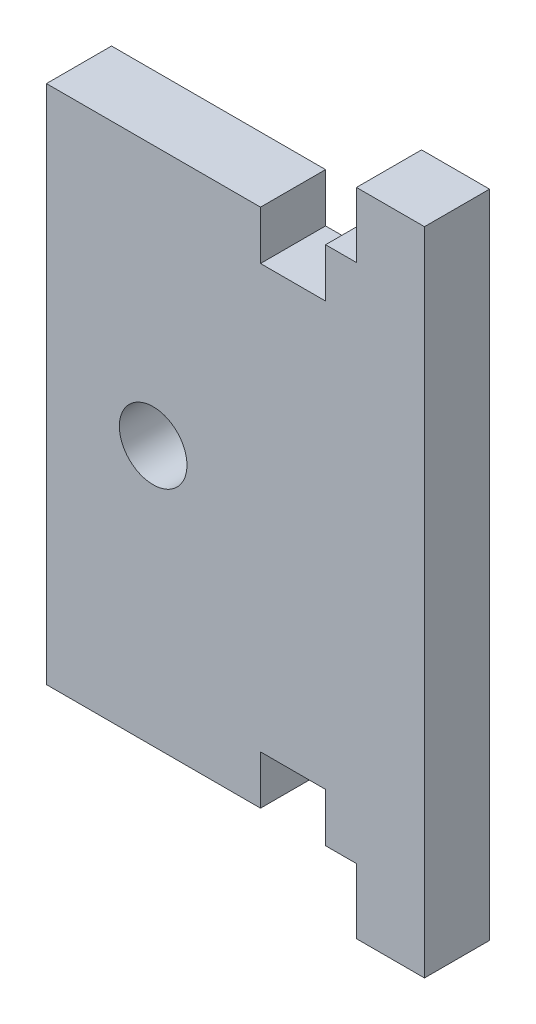
ISO-10303-21;
HEADER;
FILE_DESCRIPTION(('STEP AP214'),'2;1');
FILE_NAME('part.step','',(''),(''),'','','');
FILE_SCHEMA(('AUTOMOTIVE_DESIGN { 1 0 10303 214 1 1 1 1 }'));
ENDSEC;
DATA;
#1=APPLICATION_CONTEXT('core data for automotive mechanical design processes');
#2=APPLICATION_PROTOCOL_DEFINITION('international standard','automotive_design',2000,#1);
#3=PRODUCT_CONTEXT('',#1,'mechanical');
#4=PRODUCT('Part','Part','',(#3));
#5=PRODUCT_RELATED_PRODUCT_CATEGORY('part','',(#4));
#6=PRODUCT_DEFINITION_FORMATION('','',#4);
#7=PRODUCT_DEFINITION_CONTEXT('part definition',#1,'design');
#8=PRODUCT_DEFINITION('design','',#6,#7);
#9=PRODUCT_DEFINITION_SHAPE('','',#8);
#10=(LENGTH_UNIT() NAMED_UNIT(*) SI_UNIT(.MILLI.,.METRE.));
#11=(NAMED_UNIT(*) PLANE_ANGLE_UNIT() SI_UNIT($,.RADIAN.));
#12=(NAMED_UNIT(*) SI_UNIT($,.STERADIAN.) SOLID_ANGLE_UNIT());
#13=UNCERTAINTY_MEASURE_WITH_UNIT(LENGTH_MEASURE(1.E-05),#10,'distance_accuracy_value','');
#14=(GEOMETRIC_REPRESENTATION_CONTEXT(3) GLOBAL_UNCERTAINTY_ASSIGNED_CONTEXT((#13)) GLOBAL_UNIT_ASSIGNED_CONTEXT((#10,
#11,#12)) REPRESENTATION_CONTEXT('',''));
#15=CARTESIAN_POINT('',(0.,0.,0.));
#16=DIRECTION('',(0.,0.,1.));
#17=DIRECTION('',(1.,0.,0.));
#18=AXIS2_PLACEMENT_3D('',#15,#16,#17);
#19=CARTESIAN_POINT('',(0.,6.34999999999999,0.));
#20=DIRECTION('',(0.,1.,0.));
#21=DIRECTION('',(-1.,0.,0.));
#22=AXIS2_PLACEMENT_3D('',#19,#20,#21);
#23=PLANE('',#22);
#24=DIRECTION('',(-1.,0.,0.));
#25=VECTOR('',#24,1.);
#26=CARTESIAN_POINT('',(0.,6.34999999999999,6.35));
#27=LINE('',#26,#25);
#28=CARTESIAN_POINT('',(37.30625,6.34999999999999,6.35));
#29=VERTEX_POINT('',#28);
#30=CARTESIAN_POINT('',(34.2900000000002,6.35000000000222,6.35));
#31=VERTEX_POINT('',#30);
#32=EDGE_CURVE('E196',#29,#31,#27,.T.);
#33=ORIENTED_EDGE('',*,*,#32,.T.);
#34=DIRECTION('',(0.,0.,1.));
#35=VECTOR('',#34,1.);
#36=CARTESIAN_POINT('',(34.2900000000002,6.35000000000222,0.));
#37=LINE('',#36,#35);
#38=CARTESIAN_POINT('',(34.2900000000002,6.35000000000222,0.));
#39=VERTEX_POINT('',#38);
#40=EDGE_CURVE('E230',#39,#31,#37,.T.);
#41=ORIENTED_EDGE('',*,*,#40,.F.);
#42=DIRECTION('',(-1.,0.,0.));
#43=VECTOR('',#42,1.);
#44=CARTESIAN_POINT('',(0.,6.34999999999999,0.));
#45=LINE('',#44,#43);
#46=CARTESIAN_POINT('',(37.30625,6.34999999999999,0.));
#47=VERTEX_POINT('',#46);
#48=EDGE_CURVE('E190',#47,#39,#45,.T.);
#49=ORIENTED_EDGE('',*,*,#48,.F.);
#50=DIRECTION('',(0.,0.,1.));
#51=VECTOR('',#50,1.);
#52=CARTESIAN_POINT('',(37.30625,6.34999999999999,0.));
#53=LINE('',#52,#51);
#54=EDGE_CURVE('E189',#47,#29,#53,.T.);
#55=ORIENTED_EDGE('',*,*,#54,.T.);
#56=EDGE_LOOP('',(#33,#41,#49,#55));
#57=FACE_BOUND('',#56,.T.);
#58=ADVANCED_FACE('F35',(#57),#23,.F.);
#59=CARTESIAN_POINT('',(0.,57.1500000000035,0.));
#60=DIRECTION('',(0.,-1.,0.));
#61=DIRECTION('',(1.,0.,0.));
#62=AXIS2_PLACEMENT_3D('',#59,#60,#61);
#63=PLANE('',#62);
#64=DIRECTION('',(1.,0.,0.));
#65=VECTOR('',#64,1.);
#66=CARTESIAN_POINT('',(0.,57.1500000000035,0.));
#67=LINE('',#66,#65);
#68=CARTESIAN_POINT('',(34.2900000000002,57.1500000000034,0.));
#69=VERTEX_POINT('',#68);
#70=CARTESIAN_POINT('',(37.30625,57.1500000000035,0.));
#71=VERTEX_POINT('',#70);
#72=EDGE_CURVE('E215',#69,#71,#67,.T.);
#73=ORIENTED_EDGE('',*,*,#72,.F.);
#74=DIRECTION('',(0.,0.,1.));
#75=VECTOR('',#74,1.);
#76=CARTESIAN_POINT('',(34.2900000000002,57.1500000000034,0.));
#77=LINE('',#76,#75);
#78=CARTESIAN_POINT('',(34.2900000000002,57.1500000000034,6.35));
#79=VERTEX_POINT('',#78);
#80=EDGE_CURVE('E248',#69,#79,#77,.T.);
#81=ORIENTED_EDGE('',*,*,#80,.T.);
#82=DIRECTION('',(1.,0.,0.));
#83=VECTOR('',#82,1.);
#84=CARTESIAN_POINT('',(0.,57.1500000000035,6.35));
#85=LINE('',#84,#83);
#86=CARTESIAN_POINT('',(37.30625,57.1500000000035,6.35));
#87=VERTEX_POINT('',#86);
#88=EDGE_CURVE('E195',#79,#87,#85,.T.);
#89=ORIENTED_EDGE('',*,*,#88,.T.);
#90=DIRECTION('',(0.,0.,1.));
#91=VECTOR('',#90,1.);
#92=CARTESIAN_POINT('',(37.30625,57.1500000000035,0.));
#93=LINE('',#92,#91);
#94=EDGE_CURVE('E186',#71,#87,#93,.T.);
#95=ORIENTED_EDGE('',*,*,#94,.F.);
#96=EDGE_LOOP('',(#73,#81,#89,#95));
#97=FACE_BOUND('',#96,.T.);
#98=ADVANCED_FACE('F283',(#97),#63,.F.);
#99=CARTESIAN_POINT('',(0.,0.,6.35));
#100=DIRECTION('',(0.,1.,0.));
#101=DIRECTION('',(0.,0.,1.));
#102=AXIS2_PLACEMENT_3D('',#99,#100,#101);
#103=PLANE('',#102);
#104=DIRECTION('',(0.,0.,1.));
#105=VECTOR('',#104,1.);
#106=CARTESIAN_POINT('',(37.30625,0.,0.));
#107=LINE('',#106,#105);
#108=CARTESIAN_POINT('',(37.30625,0.,0.));
#109=VERTEX_POINT('',#108);
#110=CARTESIAN_POINT('',(37.30625,0.,6.35));
#111=VERTEX_POINT('',#110);
#112=EDGE_CURVE('E187',#109,#111,#107,.T.);
#113=ORIENTED_EDGE('',*,*,#112,.F.);
#114=DIRECTION('',(1.,0.,0.));
#115=VECTOR('',#114,1.);
#116=CARTESIAN_POINT('',(0.,0.,0.));
#117=LINE('',#116,#115);
#118=CARTESIAN_POINT('',(43.942,0.,0.));
#119=VERTEX_POINT('',#118);
#120=EDGE_CURVE('E169',#109,#119,#117,.T.);
#121=ORIENTED_EDGE('',*,*,#120,.T.);
#122=DIRECTION('',(0.,0.,-1.));
#123=VECTOR('',#122,1.);
#124=CARTESIAN_POINT('',(43.942,0.,6.35));
#125=LINE('',#124,#123);
#126=CARTESIAN_POINT('',(43.942,0.,6.35));
#127=VERTEX_POINT('',#126);
#128=EDGE_CURVE('E11',#127,#119,#125,.T.);
#129=ORIENTED_EDGE('',*,*,#128,.F.);
#130=DIRECTION('',(1.,0.,0.));
#131=VECTOR('',#130,1.);
#132=CARTESIAN_POINT('',(0.,0.,6.35));
#133=LINE('',#132,#131);
#134=EDGE_CURVE('E168',#111,#127,#133,.T.);
#135=ORIENTED_EDGE('',*,*,#134,.F.);
#136=EDGE_LOOP('',(#113,#121,#129,#135));
#137=FACE_BOUND('',#136,.T.);
#138=ADVANCED_FACE('F37',(#137),#103,.F.);
#139=CARTESIAN_POINT('',(0.,0.,6.35));
#140=DIRECTION('',(0.,0.,-1.));
#141=DIRECTION('',(-1.,0.,0.));
#142=AXIS2_PLACEMENT_3D('',#139,#140,#141);
#143=PLANE('',#142);
#144=CARTESIAN_POINT('',(17.4625000000023,31.7500000000036,6.35));
#145=DIRECTION('',(0.,0.,1.));
#146=DIRECTION('',(1.,0.,0.));
#147=AXIS2_PLACEMENT_3D('',#144,#145,#146);
#148=CIRCLE('',#147,3.29999999999999);
#149=CARTESIAN_POINT('',(20.7625000000023,31.7500000000036,6.35));
#150=VERTEX_POINT('',#149);
#151=EDGE_CURVE('E177',#150,#150,#148,.T.);
#152=ORIENTED_EDGE('',*,*,#151,.F.);
#153=EDGE_LOOP('',(#152));
#154=FACE_BOUND('',#153,.T.);
#155=DIRECTION('',(0.,1.,0.));
#156=VECTOR('',#155,1.);
#157=CARTESIAN_POINT('',(43.942,0.,6.35));
#158=LINE('',#157,#156);
#159=CARTESIAN_POINT('',(43.942,63.5,6.35));
#160=VERTEX_POINT('',#159);
#161=EDGE_CURVE('E43',#127,#160,#158,.T.);
#162=ORIENTED_EDGE('',*,*,#161,.T.);
#163=DIRECTION('',(-1.,0.,0.));
#164=VECTOR('',#163,1.);
#165=CARTESIAN_POINT('',(0.,63.5,6.35));
#166=LINE('',#165,#164);
#167=CARTESIAN_POINT('',(37.30625,63.5,6.35));
#168=VERTEX_POINT('',#167);
#169=EDGE_CURVE('E149',#160,#168,#166,.T.);
#170=ORIENTED_EDGE('',*,*,#169,.T.);
#171=DIRECTION('',(0.,-1.,0.));
#172=VECTOR('',#171,1.);
#173=CARTESIAN_POINT('',(37.30625,0.,6.35));
#174=LINE('',#173,#172);
#175=EDGE_CURVE('E213',#168,#87,#174,.T.);
#176=ORIENTED_EDGE('',*,*,#175,.T.);
#177=ORIENTED_EDGE('',*,*,#88,.F.);
#178=DIRECTION('',(0.,1.,0.));
#179=VECTOR('',#178,1.);
#180=CARTESIAN_POINT('',(34.2900000000002,57.1500000000034,6.35));
#181=LINE('',#180,#179);
#182=CARTESIAN_POINT('',(34.2900000000002,52.3875000000034,6.35));
#183=VERTEX_POINT('',#182);
#184=EDGE_CURVE('E232',#183,#79,#181,.T.);
#185=ORIENTED_EDGE('',*,*,#184,.F.);
#186=DIRECTION('',(1.,0.,0.));
#187=VECTOR('',#186,1.);
#188=CARTESIAN_POINT('',(34.2900000000002,52.3875000000034,6.35));
#189=LINE('',#188,#187);
#190=CARTESIAN_POINT('',(27.9400000000002,52.3875000000034,6.35));
#191=VERTEX_POINT('',#190);
#192=EDGE_CURVE('E257',#191,#183,#189,.T.);
#193=ORIENTED_EDGE('',*,*,#192,.F.);
#194=DIRECTION('',(0.,-1.,0.));
#195=VECTOR('',#194,1.);
#196=CARTESIAN_POINT('',(27.9400000000002,57.1500000000034,6.35));
#197=LINE('',#196,#195);
#198=CARTESIAN_POINT('',(27.9400000000002,57.1500000000034,6.35));
#199=VERTEX_POINT('',#198);
#200=EDGE_CURVE('E261',#199,#191,#197,.T.);
#201=ORIENTED_EDGE('',*,*,#200,.F.);
#202=CARTESIAN_POINT('',(7.05050000000001,57.1500000000035,6.35));
#203=VERTEX_POINT('',#202);
#204=EDGE_CURVE('E216',#203,#199,#85,.T.);
#205=ORIENTED_EDGE('',*,*,#204,.F.);
#206=DIRECTION('',(0.,1.,0.));
#207=VECTOR('',#206,1.);
#208=CARTESIAN_POINT('',(7.05050000000002,0.,6.35));
#209=LINE('',#208,#207);
#210=CARTESIAN_POINT('',(7.05050000000002,6.34999999999999,6.35));
#211=VERTEX_POINT('',#210);
#212=EDGE_CURVE('E180',#211,#203,#209,.T.);
#213=ORIENTED_EDGE('',*,*,#212,.F.);
#214=CARTESIAN_POINT('',(27.9400000000002,6.34999999999999,6.35));
#215=VERTEX_POINT('',#214);
#216=EDGE_CURVE('E200',#215,#211,#27,.T.);
#217=ORIENTED_EDGE('',*,*,#216,.F.);
#218=DIRECTION('',(0.,-1.,0.));
#219=VECTOR('',#218,1.);
#220=CARTESIAN_POINT('',(27.9400000000002,11.1125000000022,6.35));
#221=LINE('',#220,#219);
#222=CARTESIAN_POINT('',(27.9400000000002,11.1125000000022,6.35));
#223=VERTEX_POINT('',#222);
#224=EDGE_CURVE('E58',#223,#215,#221,.T.);
#225=ORIENTED_EDGE('',*,*,#224,.F.);
#226=DIRECTION('',(-1.,0.,0.));
#227=VECTOR('',#226,1.);
#228=CARTESIAN_POINT('',(34.2900000000002,11.1125000000022,6.35));
#229=LINE('',#228,#227);
#230=CARTESIAN_POINT('',(34.2900000000002,11.1125000000022,6.35));
#231=VERTEX_POINT('',#230);
#232=EDGE_CURVE('E235',#231,#223,#229,.T.);
#233=ORIENTED_EDGE('',*,*,#232,.F.);
#234=DIRECTION('',(0.,1.,0.));
#235=VECTOR('',#234,1.);
#236=CARTESIAN_POINT('',(34.2900000000002,11.1125000000022,6.35));
#237=LINE('',#236,#235);
#238=EDGE_CURVE('E238',#31,#231,#237,.T.);
#239=ORIENTED_EDGE('',*,*,#238,.F.);
#240=ORIENTED_EDGE('',*,*,#32,.F.);
#241=DIRECTION('',(0.,-1.,0.));
#242=VECTOR('',#241,1.);
#243=CARTESIAN_POINT('',(37.30625,0.,6.35));
#244=LINE('',#243,#242);
#245=EDGE_CURVE('E201',#29,#111,#244,.T.);
#246=ORIENTED_EDGE('',*,*,#245,.T.);
#247=ORIENTED_EDGE('',*,*,#134,.T.);
#248=EDGE_LOOP('',(#162,#170,#176,#177,#185,#193,#201,#205,#213,#217,#225,#233,#239,#240,#246,#247));
#249=FACE_BOUND('',#248,.T.);
#250=ADVANCED_FACE('F276',(#154,#249),#143,.F.);
#251=CARTESIAN_POINT('',(0.,0.,0.));
#252=DIRECTION('',(0.,0.,-1.));
#253=DIRECTION('',(-1.,0.,0.));
#254=AXIS2_PLACEMENT_3D('',#251,#252,#253);
#255=PLANE('',#254);
#256=DIRECTION('',(1.,0.,0.));
#257=VECTOR('',#256,1.);
#258=CARTESIAN_POINT('',(0.,63.5,0.));
#259=LINE('',#258,#257);
#260=CARTESIAN_POINT('',(37.30625,63.5,0.));
#261=VERTEX_POINT('',#260);
#262=CARTESIAN_POINT('',(43.942,63.5,0.));
#263=VERTEX_POINT('',#262);
#264=EDGE_CURVE('E50',#261,#263,#259,.T.);
#265=ORIENTED_EDGE('',*,*,#264,.T.);
#266=DIRECTION('',(0.,1.,0.));
#267=VECTOR('',#266,1.);
#268=CARTESIAN_POINT('',(43.942,0.,0.));
#269=LINE('',#268,#267);
#270=EDGE_CURVE('E162',#119,#263,#269,.T.);
#271=ORIENTED_EDGE('',*,*,#270,.F.);
#272=ORIENTED_EDGE('',*,*,#120,.F.);
#273=DIRECTION('',(0.,-1.,0.));
#274=VECTOR('',#273,1.);
#275=CARTESIAN_POINT('',(37.30625,0.,0.));
#276=LINE('',#275,#274);
#277=EDGE_CURVE('E199',#47,#109,#276,.T.);
#278=ORIENTED_EDGE('',*,*,#277,.F.);
#279=ORIENTED_EDGE('',*,*,#48,.T.);
#280=DIRECTION('',(0.,1.,0.));
#281=VECTOR('',#280,1.);
#282=CARTESIAN_POINT('',(34.2900000000002,11.1125000000022,0.));
#283=LINE('',#282,#281);
#284=CARTESIAN_POINT('',(34.2900000000002,11.1125000000022,0.));
#285=VERTEX_POINT('',#284);
#286=EDGE_CURVE('E234',#39,#285,#283,.T.);
#287=ORIENTED_EDGE('',*,*,#286,.T.);
#288=DIRECTION('',(-1.,0.,0.));
#289=VECTOR('',#288,1.);
#290=CARTESIAN_POINT('',(34.2900000000002,11.1125000000022,0.));
#291=LINE('',#290,#289);
#292=CARTESIAN_POINT('',(27.9400000000002,11.1125000000022,0.));
#293=VERTEX_POINT('',#292);
#294=EDGE_CURVE('E243',#285,#293,#291,.T.);
#295=ORIENTED_EDGE('',*,*,#294,.T.);
#296=DIRECTION('',(0.,-1.,0.));
#297=VECTOR('',#296,1.);
#298=CARTESIAN_POINT('',(27.9400000000002,11.1125000000022,0.));
#299=LINE('',#298,#297);
#300=CARTESIAN_POINT('',(27.9400000000002,6.35000000000221,0.));
#301=VERTEX_POINT('',#300);
#302=EDGE_CURVE('E226',#293,#301,#299,.T.);
#303=ORIENTED_EDGE('',*,*,#302,.T.);
#304=CARTESIAN_POINT('',(7.05050000000002,6.34999999999999,0.));
#305=VERTEX_POINT('',#304);
#306=EDGE_CURVE('E207',#301,#305,#45,.T.);
#307=ORIENTED_EDGE('',*,*,#306,.T.);
#308=DIRECTION('',(0.,-1.,0.));
#309=VECTOR('',#308,1.);
#310=CARTESIAN_POINT('',(7.05050000000002,0.,0.));
#311=LINE('',#310,#309);
#312=CARTESIAN_POINT('',(7.05050000000001,57.1500000000035,0.));
#313=VERTEX_POINT('',#312);
#314=EDGE_CURVE('E183',#313,#305,#311,.T.);
#315=ORIENTED_EDGE('',*,*,#314,.F.);
#316=CARTESIAN_POINT('',(27.9400000000002,57.1500000000035,0.));
#317=VERTEX_POINT('',#316);
#318=EDGE_CURVE('E220',#313,#317,#67,.T.);
#319=ORIENTED_EDGE('',*,*,#318,.T.);
#320=DIRECTION('',(0.,-1.,0.));
#321=VECTOR('',#320,1.);
#322=CARTESIAN_POINT('',(27.9400000000002,57.1500000000034,0.));
#323=LINE('',#322,#321);
#324=CARTESIAN_POINT('',(27.9400000000002,52.3875000000034,0.));
#325=VERTEX_POINT('',#324);
#326=EDGE_CURVE('E267',#317,#325,#323,.T.);
#327=ORIENTED_EDGE('',*,*,#326,.T.);
#328=DIRECTION('',(1.,0.,0.));
#329=VECTOR('',#328,1.);
#330=CARTESIAN_POINT('',(34.2900000000002,52.3875000000034,0.));
#331=LINE('',#330,#329);
#332=CARTESIAN_POINT('',(34.2900000000002,52.3875000000034,0.));
#333=VERTEX_POINT('',#332);
#334=EDGE_CURVE('E252',#325,#333,#331,.T.);
#335=ORIENTED_EDGE('',*,*,#334,.T.);
#336=DIRECTION('',(0.,1.,0.));
#337=VECTOR('',#336,1.);
#338=CARTESIAN_POINT('',(34.2900000000002,57.1500000000034,0.));
#339=LINE('',#338,#337);
#340=EDGE_CURVE('E260',#333,#69,#339,.T.);
#341=ORIENTED_EDGE('',*,*,#340,.T.);
#342=ORIENTED_EDGE('',*,*,#72,.T.);
#343=DIRECTION('',(0.,-1.,0.));
#344=VECTOR('',#343,1.);
#345=CARTESIAN_POINT('',(37.30625,0.,0.));
#346=LINE('',#345,#344);
#347=EDGE_CURVE('E164',#261,#71,#346,.T.);
#348=ORIENTED_EDGE('',*,*,#347,.F.);
#349=EDGE_LOOP('',(#265,#271,#272,#278,#279,#287,#295,#303,#307,#315,#319,#327,#335,#341,#342,#348));
#350=FACE_BOUND('',#349,.T.);
#351=CARTESIAN_POINT('',(17.4625000000023,31.7500000000036,0.));
#352=DIRECTION('',(0.,0.,1.));
#353=DIRECTION('',(1.,0.,0.));
#354=AXIS2_PLACEMENT_3D('',#351,#352,#353);
#355=CIRCLE('',#354,3.3);
#356=CARTESIAN_POINT('',(20.7625000000023,31.7500000000036,0.));
#357=VERTEX_POINT('',#356);
#358=EDGE_CURVE('E171',#357,#357,#355,.T.);
#359=ORIENTED_EDGE('',*,*,#358,.T.);
#360=EDGE_LOOP('',(#359));
#361=FACE_BOUND('',#360,.T.);
#362=ADVANCED_FACE('F159',(#350,#361),#255,.T.);
#363=CARTESIAN_POINT('',(43.942,0.,6.35));
#364=DIRECTION('',(-1.,0.,0.));
#365=DIRECTION('',(0.,0.,1.));
#366=AXIS2_PLACEMENT_3D('',#363,#364,#365);
#367=PLANE('',#366);
#368=ORIENTED_EDGE('',*,*,#270,.T.);
#369=DIRECTION('',(0.,0.,1.));
#370=VECTOR('',#369,1.);
#371=CARTESIAN_POINT('',(43.942,63.5,0.));
#372=LINE('',#371,#370);
#373=EDGE_CURVE('E146',#263,#160,#372,.T.);
#374=ORIENTED_EDGE('',*,*,#373,.T.);
#375=ORIENTED_EDGE('',*,*,#161,.F.);
#376=ORIENTED_EDGE('',*,*,#128,.T.);
#377=EDGE_LOOP('',(#368,#374,#375,#376));
#378=FACE_BOUND('',#377,.T.);
#379=ADVANCED_FACE('F166',(#378),#367,.F.);
#380=CARTESIAN_POINT('',(17.4625000000023,31.7500000000036,6.35));
#381=DIRECTION('',(0.,0.,1.));
#382=DIRECTION('',(1.,0.,0.));
#383=AXIS2_PLACEMENT_3D('',#380,#381,#382);
#384=CYLINDRICAL_SURFACE('',#383,3.29999999999999);
#385=ORIENTED_EDGE('',*,*,#358,.F.);
#386=EDGE_LOOP('',(#385));
#387=FACE_BOUND('',#386,.T.);
#388=ORIENTED_EDGE('',*,*,#151,.T.);
#389=EDGE_LOOP('',(#388));
#390=FACE_BOUND('',#389,.T.);
#391=ADVANCED_FACE('F346',(#387,#390),#384,.F.);
#392=CARTESIAN_POINT('',(7.05050000000002,0.,0.));
#393=DIRECTION('',(-1.,0.,0.));
#394=DIRECTION('',(0.,-1.,0.));
#395=AXIS2_PLACEMENT_3D('',#392,#393,#394);
#396=PLANE('',#395);
#397=DIRECTION('',(0.,0.,1.));
#398=VECTOR('',#397,1.);
#399=CARTESIAN_POINT('',(7.05050000000001,57.1500000000035,0.));
#400=LINE('',#399,#398);
#401=EDGE_CURVE('E209',#313,#203,#400,.T.);
#402=ORIENTED_EDGE('',*,*,#401,.F.);
#403=ORIENTED_EDGE('',*,*,#314,.T.);
#404=DIRECTION('',(0.,0.,1.));
#405=VECTOR('',#404,1.);
#406=CARTESIAN_POINT('',(7.05050000000002,6.34999999999999,0.));
#407=LINE('',#406,#405);
#408=EDGE_CURVE('E192',#305,#211,#407,.T.);
#409=ORIENTED_EDGE('',*,*,#408,.T.);
#410=ORIENTED_EDGE('',*,*,#212,.T.);
#411=EDGE_LOOP('',(#402,#403,#409,#410));
#412=FACE_BOUND('',#411,.T.);
#413=ADVANCED_FACE('F303',(#412),#396,.T.);
#414=ORIENTED_EDGE('',*,*,#306,.F.);
#415=DIRECTION('',(0.,0.,1.));
#416=VECTOR('',#415,1.);
#417=CARTESIAN_POINT('',(27.9400000000002,6.35000000000221,0.));
#418=LINE('',#417,#416);
#419=EDGE_CURVE('E228',#301,#215,#418,.T.);
#420=ORIENTED_EDGE('',*,*,#419,.T.);
#421=ORIENTED_EDGE('',*,*,#216,.T.);
#422=ORIENTED_EDGE('',*,*,#408,.F.);
#423=EDGE_LOOP('',(#414,#420,#421,#422));
#424=FACE_BOUND('',#423,.T.);
#425=ADVANCED_FACE('F308',(#424),#23,.F.);
#426=CARTESIAN_POINT('',(37.30625,0.,0.));
#427=DIRECTION('',(-1.,0.,0.));
#428=DIRECTION('',(0.,-1.,0.));
#429=AXIS2_PLACEMENT_3D('',#426,#427,#428);
#430=PLANE('',#429);
#431=ORIENTED_EDGE('',*,*,#245,.F.);
#432=ORIENTED_EDGE('',*,*,#54,.F.);
#433=ORIENTED_EDGE('',*,*,#277,.T.);
#434=ORIENTED_EDGE('',*,*,#112,.T.);
#435=EDGE_LOOP('',(#431,#432,#433,#434));
#436=FACE_BOUND('',#435,.T.);
#437=ADVANCED_FACE('F325',(#436),#430,.T.);
#438=CARTESIAN_POINT('',(37.30625,0.,0.));
#439=DIRECTION('',(-1.,0.,0.));
#440=DIRECTION('',(0.,-1.,0.));
#441=AXIS2_PLACEMENT_3D('',#438,#439,#440);
#442=PLANE('',#441);
#443=DIRECTION('',(0.,0.,1.));
#444=VECTOR('',#443,1.);
#445=CARTESIAN_POINT('',(37.30625,63.5,0.));
#446=LINE('',#445,#444);
#447=EDGE_CURVE('E154',#261,#168,#446,.T.);
#448=ORIENTED_EDGE('',*,*,#447,.F.);
#449=ORIENTED_EDGE('',*,*,#347,.T.);
#450=ORIENTED_EDGE('',*,*,#94,.T.);
#451=ORIENTED_EDGE('',*,*,#175,.F.);
#452=EDGE_LOOP('',(#448,#449,#450,#451));
#453=FACE_BOUND('',#452,.T.);
#454=ADVANCED_FACE('F279',(#453),#442,.T.);
#455=ORIENTED_EDGE('',*,*,#204,.T.);
#456=DIRECTION('',(0.,0.,1.));
#457=VECTOR('',#456,1.);
#458=CARTESIAN_POINT('',(27.9400000000002,57.1500000000034,0.));
#459=LINE('',#458,#457);
#460=EDGE_CURVE('E251',#317,#199,#459,.T.);
#461=ORIENTED_EDGE('',*,*,#460,.F.);
#462=ORIENTED_EDGE('',*,*,#318,.F.);
#463=ORIENTED_EDGE('',*,*,#401,.T.);
#464=EDGE_LOOP('',(#455,#461,#462,#463));
#465=FACE_BOUND('',#464,.T.);
#466=ADVANCED_FACE('F299',(#465),#63,.F.);
#467=CARTESIAN_POINT('',(34.2900000000002,57.1500000000034,0.));
#468=DIRECTION('',(1.,0.,0.));
#469=DIRECTION('',(0.,0.,-1.));
#470=AXIS2_PLACEMENT_3D('',#467,#468,#469);
#471=PLANE('',#470);
#472=ORIENTED_EDGE('',*,*,#184,.T.);
#473=ORIENTED_EDGE('',*,*,#80,.F.);
#474=ORIENTED_EDGE('',*,*,#340,.F.);
#475=DIRECTION('',(0.,0.,1.));
#476=VECTOR('',#475,1.);
#477=CARTESIAN_POINT('',(34.2900000000002,52.3875000000034,0.));
#478=LINE('',#477,#476);
#479=EDGE_CURVE('E204',#333,#183,#478,.T.);
#480=ORIENTED_EDGE('',*,*,#479,.T.);
#481=EDGE_LOOP('',(#472,#473,#474,#480));
#482=FACE_BOUND('',#481,.T.);
#483=ADVANCED_FACE('F288',(#482),#471,.F.);
#484=CARTESIAN_POINT('',(34.2900000000002,52.3875000000034,0.));
#485=DIRECTION('',(0.,-1.,0.));
#486=DIRECTION('',(0.,0.,-1.));
#487=AXIS2_PLACEMENT_3D('',#484,#485,#486);
#488=PLANE('',#487);
#489=ORIENTED_EDGE('',*,*,#192,.T.);
#490=ORIENTED_EDGE('',*,*,#479,.F.);
#491=ORIENTED_EDGE('',*,*,#334,.F.);
#492=DIRECTION('',(0.,0.,1.));
#493=VECTOR('',#492,1.);
#494=CARTESIAN_POINT('',(27.9400000000002,52.3875000000034,0.));
#495=LINE('',#494,#493);
#496=EDGE_CURVE('E254',#325,#191,#495,.T.);
#497=ORIENTED_EDGE('',*,*,#496,.T.);
#498=EDGE_LOOP('',(#489,#490,#491,#497));
#499=FACE_BOUND('',#498,.T.);
#500=ADVANCED_FACE('F292',(#499),#488,.F.);
#501=CARTESIAN_POINT('',(27.9400000000002,57.1500000000034,0.));
#502=DIRECTION('',(-1.,0.,0.));
#503=DIRECTION('',(0.,0.,1.));
#504=AXIS2_PLACEMENT_3D('',#501,#502,#503);
#505=PLANE('',#504);
#506=ORIENTED_EDGE('',*,*,#200,.T.);
#507=ORIENTED_EDGE('',*,*,#496,.F.);
#508=ORIENTED_EDGE('',*,*,#326,.F.);
#509=ORIENTED_EDGE('',*,*,#460,.T.);
#510=EDGE_LOOP('',(#506,#507,#508,#509));
#511=FACE_BOUND('',#510,.T.);
#512=ADVANCED_FACE('F294',(#511),#505,.F.);
#513=CARTESIAN_POINT('',(34.2900000000002,11.1125000000022,0.));
#514=DIRECTION('',(1.,0.,0.));
#515=DIRECTION('',(0.,0.,-1.));
#516=AXIS2_PLACEMENT_3D('',#513,#514,#515);
#517=PLANE('',#516);
#518=ORIENTED_EDGE('',*,*,#238,.T.);
#519=DIRECTION('',(0.,0.,1.));
#520=VECTOR('',#519,1.);
#521=CARTESIAN_POINT('',(34.2900000000002,11.1125000000022,0.));
#522=LINE('',#521,#520);
#523=EDGE_CURVE('E223',#285,#231,#522,.T.);
#524=ORIENTED_EDGE('',*,*,#523,.F.);
#525=ORIENTED_EDGE('',*,*,#286,.F.);
#526=ORIENTED_EDGE('',*,*,#40,.T.);
#527=EDGE_LOOP('',(#518,#524,#525,#526));
#528=FACE_BOUND('',#527,.T.);
#529=ADVANCED_FACE('F317',(#528),#517,.F.);
#530=CARTESIAN_POINT('',(27.9400000000002,11.1125000000022,0.));
#531=DIRECTION('',(-1.,0.,0.));
#532=DIRECTION('',(0.,0.,1.));
#533=AXIS2_PLACEMENT_3D('',#530,#531,#532);
#534=PLANE('',#533);
#535=ORIENTED_EDGE('',*,*,#224,.T.);
#536=ORIENTED_EDGE('',*,*,#419,.F.);
#537=ORIENTED_EDGE('',*,*,#302,.F.);
#538=DIRECTION('',(0.,0.,1.));
#539=VECTOR('',#538,1.);
#540=CARTESIAN_POINT('',(27.9400000000002,11.1125000000022,0.));
#541=LINE('',#540,#539);
#542=EDGE_CURVE('E225',#293,#223,#541,.T.);
#543=ORIENTED_EDGE('',*,*,#542,.T.);
#544=EDGE_LOOP('',(#535,#536,#537,#543));
#545=FACE_BOUND('',#544,.T.);
#546=ADVANCED_FACE('F437',(#545),#534,.F.);
#547=CARTESIAN_POINT('',(34.2900000000002,11.1125000000022,0.));
#548=DIRECTION('',(0.,1.,0.));
#549=DIRECTION('',(0.,0.,1.));
#550=AXIS2_PLACEMENT_3D('',#547,#548,#549);
#551=PLANE('',#550);
#552=ORIENTED_EDGE('',*,*,#232,.T.);
#553=ORIENTED_EDGE('',*,*,#542,.F.);
#554=ORIENTED_EDGE('',*,*,#294,.F.);
#555=ORIENTED_EDGE('',*,*,#523,.T.);
#556=EDGE_LOOP('',(#552,#553,#554,#555));
#557=FACE_BOUND('',#556,.T.);
#558=ADVANCED_FACE('F314',(#557),#551,.F.);
#559=CARTESIAN_POINT('',(0.,63.5,0.));
#560=DIRECTION('',(0.,-1.,0.));
#561=DIRECTION('',(0.,0.,-1.));
#562=AXIS2_PLACEMENT_3D('',#559,#560,#561);
#563=PLANE('',#562);
#564=ORIENTED_EDGE('',*,*,#373,.F.);
#565=ORIENTED_EDGE('',*,*,#264,.F.);
#566=ORIENTED_EDGE('',*,*,#447,.T.);
#567=ORIENTED_EDGE('',*,*,#169,.F.);
#568=EDGE_LOOP('',(#564,#565,#566,#567));
#569=FACE_BOUND('',#568,.T.);
#570=ADVANCED_FACE('F147',(#569),#563,.F.);
#571=CLOSED_SHELL('',(#58,#98,#138,#250,#362,#379,#391,#413,#425,#437,#454,#466,#483,#500,#512,
#529,#546,#558,#570));
#572=MANIFOLD_SOLID_BREP('B2',#571);
#573=ADVANCED_BREP_SHAPE_REPRESENTATION('',(#18,#572),#14);
#574=SHAPE_DEFINITION_REPRESENTATION(#9,#573);
ENDSEC;
END-ISO-10303-21;
